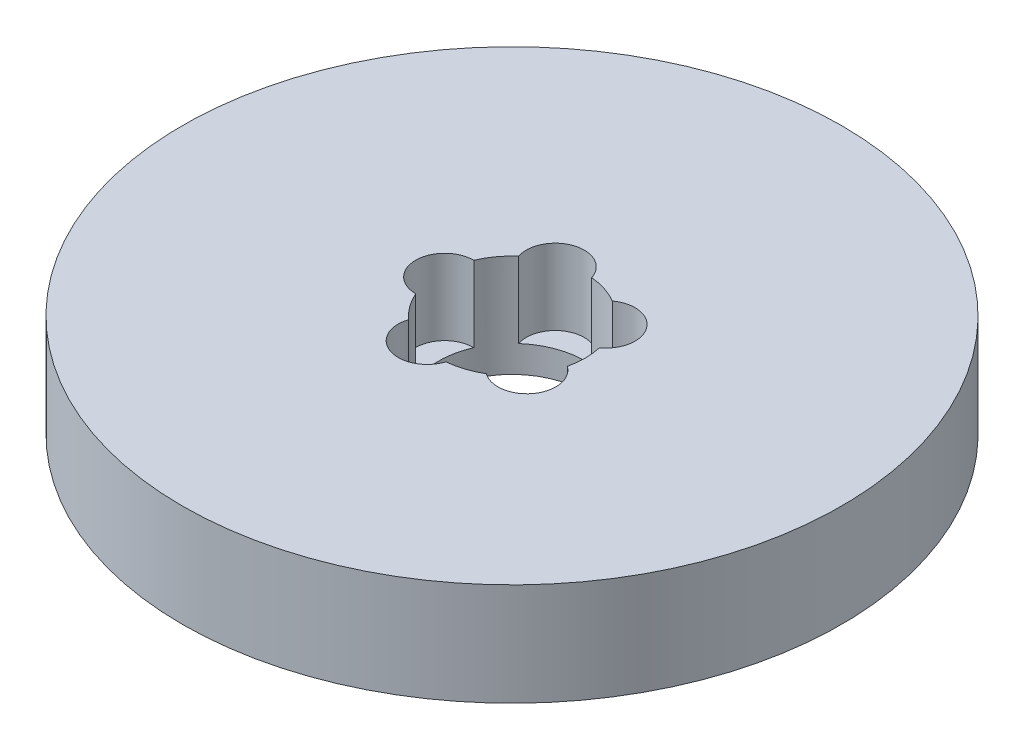
ISO-10303-21;
HEADER;
FILE_DESCRIPTION(('STEP AP214'),'2;1');
FILE_NAME('part.step','',(''),(''),'','','');
FILE_SCHEMA(('AUTOMOTIVE_DESIGN { 1 0 10303 214 1 1 1 1 }'));
ENDSEC;
DATA;
#1=APPLICATION_CONTEXT('core data for automotive mechanical design processes');
#2=APPLICATION_PROTOCOL_DEFINITION('international standard','automotive_design',2000,#1);
#3=PRODUCT_CONTEXT('',#1,'mechanical');
#4=PRODUCT('Part','Part','',(#3));
#5=PRODUCT_RELATED_PRODUCT_CATEGORY('part','',(#4));
#6=PRODUCT_DEFINITION_FORMATION('','',#4);
#7=PRODUCT_DEFINITION_CONTEXT('part definition',#1,'design');
#8=PRODUCT_DEFINITION('design','',#6,#7);
#9=PRODUCT_DEFINITION_SHAPE('','',#8);
#10=(LENGTH_UNIT() NAMED_UNIT(*) SI_UNIT(.MILLI.,.METRE.));
#11=(NAMED_UNIT(*) PLANE_ANGLE_UNIT() SI_UNIT($,.RADIAN.));
#12=(NAMED_UNIT(*) SI_UNIT($,.STERADIAN.) SOLID_ANGLE_UNIT());
#13=UNCERTAINTY_MEASURE_WITH_UNIT(LENGTH_MEASURE(1.E-05),#10,'distance_accuracy_value','');
#14=(GEOMETRIC_REPRESENTATION_CONTEXT(3) GLOBAL_UNCERTAINTY_ASSIGNED_CONTEXT((#13)) GLOBAL_UNIT_ASSIGNED_CONTEXT((#10,
#11,#12)) REPRESENTATION_CONTEXT('',''));
#15=CARTESIAN_POINT('',(0.,0.,0.));
#16=DIRECTION('',(0.,0.,1.));
#17=DIRECTION('',(1.,0.,0.));
#18=AXIS2_PLACEMENT_3D('',#15,#16,#17);
#19=CARTESIAN_POINT('',(0.,7.,0.));
#20=DIRECTION('',(0.,-1.,0.));
#21=DIRECTION('',(0.,0.,-1.));
#22=AXIS2_PLACEMENT_3D('',#19,#20,#21);
#23=CYLINDRICAL_SURFACE('',#22,22.5);
#24=CARTESIAN_POINT('',(0.,7.,0.));
#25=DIRECTION('',(0.,1.,0.));
#26=DIRECTION('',(0.,0.,1.));
#27=AXIS2_PLACEMENT_3D('',#24,#25,#26);
#28=CIRCLE('',#27,22.5);
#29=CARTESIAN_POINT('',(0.,7.,22.5));
#30=VERTEX_POINT('',#29);
#31=EDGE_CURVE('E157',#30,#30,#28,.T.);
#32=ORIENTED_EDGE('',*,*,#31,.F.);
#33=EDGE_LOOP('',(#32));
#34=FACE_BOUND('',#33,.T.);
#35=CARTESIAN_POINT('',(0.,0.,0.));
#36=DIRECTION('',(0.,1.,0.));
#37=DIRECTION('',(0.,0.,1.));
#38=AXIS2_PLACEMENT_3D('',#35,#36,#37);
#39=CIRCLE('',#38,22.5);
#40=CARTESIAN_POINT('',(0.,0.,22.5));
#41=VERTEX_POINT('',#40);
#42=EDGE_CURVE('E150',#41,#41,#39,.T.);
#43=ORIENTED_EDGE('',*,*,#42,.T.);
#44=EDGE_LOOP('',(#43));
#45=FACE_BOUND('',#44,.T.);
#46=ADVANCED_FACE('F39',(#34,#45),#23,.T.);
#47=CARTESIAN_POINT('',(0.,7.,0.));
#48=DIRECTION('',(0.,1.,0.));
#49=DIRECTION('',(0.,0.,1.));
#50=AXIS2_PLACEMENT_3D('',#47,#48,#49);
#51=PLANE('',#50);
#52=CARTESIAN_POINT('',(-1.42031490346653,7.,-4.37127979600344));
#53=DIRECTION('',(0.,1.,0.));
#54=DIRECTION('',(-0.95105651629515,0.,0.309016994374958));
#55=AXIS2_PLACEMENT_3D('',#52,#53,#54);
#56=CIRCLE('',#55,1.98142630119609);
#57=CARTESIAN_POINT('',(0.465854922201812,7.,-4.97825061557374));
#58=VERTEX_POINT('',#57);
#59=CARTESIAN_POINT('',(-3.30302684302474,7.,-3.75366669727854));
#60=VERTEX_POINT('',#59);
#61=EDGE_CURVE('E194',#58,#60,#56,.T.);
#62=ORIENTED_EDGE('',*,*,#61,.F.);
#63=CARTESIAN_POINT('',(0.,7.,0.));
#64=DIRECTION('',(0.,1.,0.));
#65=DIRECTION('',(0.,0.,1.));
#66=AXIS2_PLACEMENT_3D('',#63,#64,#65);
#67=CIRCLE('',#66,5.);
#68=CARTESIAN_POINT('',(2.5492577450756,7.,-4.30131200323483));
#69=VERTEX_POINT('',#68);
#70=EDGE_CURVE('E147',#69,#58,#67,.T.);
#71=ORIENTED_EDGE('',*,*,#70,.F.);
#72=CARTESIAN_POINT('',(3.71843269200326,7.,-2.70159948826588));
#73=DIRECTION('',(0.,1.,0.));
#74=DIRECTION('',(-0.58778525229248,0.,-0.809016994374942));
#75=AXIS2_PLACEMENT_3D('',#72,#73,#74);
#76=CIRCLE('',#75,1.98142630119609);
#77=CARTESIAN_POINT('',(4.87855477556535,7.,-1.09530968306161));
#78=VERTEX_POINT('',#77);
#79=EDGE_CURVE('E254',#78,#69,#76,.T.);
#80=ORIENTED_EDGE('',*,*,#79,.F.);
#81=CARTESIAN_POINT('',(4.87855477556537,7.,1.09530968306154));
#82=VERTEX_POINT('',#81);
#83=EDGE_CURVE('E144',#82,#78,#67,.T.);
#84=ORIENTED_EDGE('',*,*,#83,.F.);
#85=CARTESIAN_POINT('',(3.7184326920033,7.,2.70159948826582));
#86=DIRECTION('',(0.,1.,0.));
#87=DIRECTION('',(0.587785252292469,0.,-0.809016994374951));
#88=AXIS2_PLACEMENT_3D('',#85,#86,#87);
#89=CIRCLE('',#88,1.98142630119609);
#90=CARTESIAN_POINT('',(2.54925774507566,7.,4.3013120032348));
#91=VERTEX_POINT('',#90);
#92=EDGE_CURVE('E141',#91,#82,#89,.T.);
#93=ORIENTED_EDGE('',*,*,#92,.F.);
#94=CARTESIAN_POINT('',(0.465854922201883,7.,4.97825061557374));
#95=VERTEX_POINT('',#94);
#96=EDGE_CURVE('E134',#95,#91,#67,.T.);
#97=ORIENTED_EDGE('',*,*,#96,.F.);
#98=CARTESIAN_POINT('',(-1.42031490346647,7.,4.37127979600346));
#99=DIRECTION('',(0.,1.,0.));
#100=DIRECTION('',(0.951056516295155,0.,0.309016994374945));
#101=AXIS2_PLACEMENT_3D('',#98,#99,#100);
#102=CIRCLE('',#101,1.98142630119609);
#103=CARTESIAN_POINT('',(-3.30302684302469,7.,3.75366669727859));
#104=VERTEX_POINT('',#103);
#105=EDGE_CURVE('E111',#104,#95,#102,.T.);
#106=ORIENTED_EDGE('',*,*,#105,.F.);
#107=CARTESIAN_POINT('',(-4.59064059981817,7.,1.98141840187809));
#108=VERTEX_POINT('',#107);
#109=EDGE_CURVE('E145',#108,#104,#67,.T.);
#110=ORIENTED_EDGE('',*,*,#109,.F.);
#111=CARTESIAN_POINT('',(-4.5962355770736,7.,0.));
#112=DIRECTION('',(0.,1.,0.));
#113=DIRECTION('',(0.,0.,1.));
#114=AXIS2_PLACEMENT_3D('',#111,#112,#113);
#115=CIRCLE('',#114,1.98142630119609);
#116=CARTESIAN_POINT('',(-4.59064059981817,7.,-1.98141840187809));
#117=VERTEX_POINT('',#116);
#118=EDGE_CURVE('E153',#117,#108,#115,.T.);
#119=ORIENTED_EDGE('',*,*,#118,.F.);
#120=EDGE_CURVE('E146',#60,#117,#67,.T.);
#121=ORIENTED_EDGE('',*,*,#120,.F.);
#122=EDGE_LOOP('',(#62,#71,#80,#84,#93,#97,#106,#110,#119,#121));
#123=FACE_BOUND('',#122,.T.);
#124=ORIENTED_EDGE('',*,*,#31,.T.);
#125=EDGE_LOOP('',(#124));
#126=FACE_BOUND('',#125,.T.);
#127=ADVANCED_FACE('F139',(#123,#126),#51,.T.);
#128=CARTESIAN_POINT('',(0.,0.,0.));
#129=DIRECTION('',(0.,1.,0.));
#130=DIRECTION('',(0.,0.,1.));
#131=AXIS2_PLACEMENT_3D('',#128,#129,#130);
#132=PLANE('',#131);
#133=CARTESIAN_POINT('',(0.,0.,0.));
#134=DIRECTION('',(0.,1.,0.));
#135=DIRECTION('',(0.,0.,1.));
#136=AXIS2_PLACEMENT_3D('',#133,#134,#135);
#137=CIRCLE('',#136,5.);
#138=CARTESIAN_POINT('',(0.,0.,5.));
#139=VERTEX_POINT('',#138);
#140=EDGE_CURVE('E154',#139,#139,#137,.T.);
#141=ORIENTED_EDGE('',*,*,#140,.T.);
#142=EDGE_LOOP('',(#141));
#143=FACE_BOUND('',#142,.T.);
#144=ORIENTED_EDGE('',*,*,#42,.F.);
#145=EDGE_LOOP('',(#144));
#146=FACE_BOUND('',#145,.T.);
#147=ADVANCED_FACE('F213',(#143,#146),#132,.F.);
#148=CARTESIAN_POINT('',(0.,7.,0.));
#149=DIRECTION('',(0.,-1.,0.));
#150=DIRECTION('',(0.,0.,-1.));
#151=AXIS2_PLACEMENT_3D('',#148,#149,#150);
#152=CYLINDRICAL_SURFACE('',#151,5.);
#153=DIRECTION('',(0.,1.,0.));
#154=VECTOR('',#153,1.);
#155=CARTESIAN_POINT('',(0.465854922201813,4.41702713443401,-4.97825061557374));
#156=LINE('',#155,#154);
#157=CARTESIAN_POINT('',(0.465854922201812,1.83405426886802,-4.97825061557374));
#158=VERTEX_POINT('',#157);
#159=EDGE_CURVE('E11',#158,#58,#156,.T.);
#160=ORIENTED_EDGE('',*,*,#159,.F.);
#161=CARTESIAN_POINT('',(0.,1.83405426886802,0.));
#162=DIRECTION('',(0.,1.,0.));
#163=DIRECTION('',(0.,0.,1.));
#164=AXIS2_PLACEMENT_3D('',#161,#162,#163);
#165=CIRCLE('',#164,5.);
#166=CARTESIAN_POINT('',(-3.30302684302474,1.83405426886802,-3.75366669727854));
#167=VERTEX_POINT('',#166);
#168=EDGE_CURVE('E189',#158,#167,#165,.T.);
#169=ORIENTED_EDGE('',*,*,#168,.T.);
#170=DIRECTION('',(0.,1.,0.));
#171=VECTOR('',#170,1.);
#172=CARTESIAN_POINT('',(-3.30302684302474,4.41702713443401,-3.75366669727854));
#173=LINE('',#172,#171);
#174=EDGE_CURVE('E46',#60,#167,#173,.F.);
#175=ORIENTED_EDGE('',*,*,#174,.F.);
#176=ORIENTED_EDGE('',*,*,#120,.T.);
#177=DIRECTION('',(0.,1.,0.));
#178=VECTOR('',#177,1.);
#179=CARTESIAN_POINT('',(-4.59064059981817,4.41702713443401,-1.98141840187809));
#180=LINE('',#179,#178);
#181=CARTESIAN_POINT('',(-4.59064059981817,1.83405426886802,-1.98141840187809));
#182=VERTEX_POINT('',#181);
#183=EDGE_CURVE('E168',#182,#117,#180,.T.);
#184=ORIENTED_EDGE('',*,*,#183,.F.);
#185=CARTESIAN_POINT('',(0.,1.83405426886802,0.));
#186=DIRECTION('',(0.,1.,0.));
#187=DIRECTION('',(0.,0.,1.));
#188=AXIS2_PLACEMENT_3D('',#185,#186,#187);
#189=CIRCLE('',#188,5.);
#190=CARTESIAN_POINT('',(-4.59064059981817,1.83405426886802,1.98141840187809));
#191=VERTEX_POINT('',#190);
#192=EDGE_CURVE('E165',#182,#191,#189,.T.);
#193=ORIENTED_EDGE('',*,*,#192,.T.);
#194=DIRECTION('',(0.,1.,0.));
#195=VECTOR('',#194,1.);
#196=CARTESIAN_POINT('',(-4.59064059981817,4.41702713443401,1.98141840187809));
#197=LINE('',#196,#195);
#198=EDGE_CURVE('E170',#108,#191,#197,.F.);
#199=ORIENTED_EDGE('',*,*,#198,.F.);
#200=ORIENTED_EDGE('',*,*,#109,.T.);
#201=DIRECTION('',(0.,1.,0.));
#202=VECTOR('',#201,1.);
#203=CARTESIAN_POINT('',(-3.30302684302469,4.41702713443401,3.75366669727859));
#204=LINE('',#203,#202);
#205=CARTESIAN_POINT('',(-3.30302684302469,1.83405426886802,3.75366669727859));
#206=VERTEX_POINT('',#205);
#207=EDGE_CURVE('E121',#206,#104,#204,.T.);
#208=ORIENTED_EDGE('',*,*,#207,.F.);
#209=CARTESIAN_POINT('',(0.,1.83405426886802,0.));
#210=DIRECTION('',(0.,1.,0.));
#211=DIRECTION('',(0.,0.,1.));
#212=AXIS2_PLACEMENT_3D('',#209,#210,#211);
#213=CIRCLE('',#212,5.);
#214=CARTESIAN_POINT('',(0.465854922201883,1.83405426886802,4.97825061557374));
#215=VERTEX_POINT('',#214);
#216=EDGE_CURVE('E136',#206,#215,#213,.T.);
#217=ORIENTED_EDGE('',*,*,#216,.T.);
#218=DIRECTION('',(0.,1.,0.));
#219=VECTOR('',#218,1.);
#220=CARTESIAN_POINT('',(0.465854922201883,4.41702713443401,4.97825061557374));
#221=LINE('',#220,#219);
#222=EDGE_CURVE('E117',#95,#215,#221,.F.);
#223=ORIENTED_EDGE('',*,*,#222,.F.);
#224=ORIENTED_EDGE('',*,*,#96,.T.);
#225=DIRECTION('',(0.,1.,0.));
#226=VECTOR('',#225,1.);
#227=CARTESIAN_POINT('',(2.54925774507566,4.41702713443401,4.3013120032348));
#228=LINE('',#227,#226);
#229=CARTESIAN_POINT('',(2.54925774507566,1.83405426886802,4.3013120032348));
#230=VERTEX_POINT('',#229);
#231=EDGE_CURVE('E182',#230,#91,#228,.T.);
#232=ORIENTED_EDGE('',*,*,#231,.F.);
#233=CARTESIAN_POINT('',(0.,1.83405426886802,0.));
#234=DIRECTION('',(0.,1.,0.));
#235=DIRECTION('',(0.,0.,1.));
#236=AXIS2_PLACEMENT_3D('',#233,#234,#235);
#237=CIRCLE('',#236,5.);
#238=CARTESIAN_POINT('',(4.87855477556537,1.83405426886802,1.09530968306154));
#239=VERTEX_POINT('',#238);
#240=EDGE_CURVE('E174',#230,#239,#237,.T.);
#241=ORIENTED_EDGE('',*,*,#240,.T.);
#242=DIRECTION('',(0.,1.,0.));
#243=VECTOR('',#242,1.);
#244=CARTESIAN_POINT('',(4.87855477556537,4.41702713443401,1.09530968306154));
#245=LINE('',#244,#243);
#246=EDGE_CURVE('E177',#82,#239,#245,.F.);
#247=ORIENTED_EDGE('',*,*,#246,.F.);
#248=ORIENTED_EDGE('',*,*,#83,.T.);
#249=DIRECTION('',(0.,1.,0.));
#250=VECTOR('',#249,1.);
#251=CARTESIAN_POINT('',(4.87855477556535,4.41702713443401,-1.09530968306161));
#252=LINE('',#251,#250);
#253=CARTESIAN_POINT('',(4.87855477556535,1.83405426886802,-1.09530968306161));
#254=VERTEX_POINT('',#253);
#255=EDGE_CURVE('E187',#254,#78,#252,.T.);
#256=ORIENTED_EDGE('',*,*,#255,.F.);
#257=CARTESIAN_POINT('',(0.,1.83405426886802,0.));
#258=DIRECTION('',(0.,1.,0.));
#259=DIRECTION('',(0.,0.,1.));
#260=AXIS2_PLACEMENT_3D('',#257,#258,#259);
#261=CIRCLE('',#260,5.);
#262=CARTESIAN_POINT('',(2.5492577450756,1.83405426886802,-4.30131200323483));
#263=VERTEX_POINT('',#262);
#264=EDGE_CURVE('E181',#254,#263,#261,.T.);
#265=ORIENTED_EDGE('',*,*,#264,.T.);
#266=DIRECTION('',(0.,1.,0.));
#267=VECTOR('',#266,1.);
#268=CARTESIAN_POINT('',(2.5492577450756,4.41702713443401,-4.30131200323483));
#269=LINE('',#268,#267);
#270=EDGE_CURVE('E186',#69,#263,#269,.F.);
#271=ORIENTED_EDGE('',*,*,#270,.F.);
#272=ORIENTED_EDGE('',*,*,#70,.T.);
#273=EDGE_LOOP('',(#160,#169,#175,#176,#184,#193,#199,#200,#208,#217,#223,#224,#232,#241,#247,
#248,#256,#265,#271,#272));
#274=FACE_BOUND('',#273,.T.);
#275=ORIENTED_EDGE('',*,*,#140,.F.);
#276=EDGE_LOOP('',(#275));
#277=FACE_BOUND('',#276,.T.);
#278=ADVANCED_FACE('F135',(#274,#277),#152,.F.);
#279=CARTESIAN_POINT('',(-4.5962355770736,1.83405426886802,0.));
#280=DIRECTION('',(0.,1.,0.));
#281=DIRECTION('',(0.,0.,1.));
#282=AXIS2_PLACEMENT_3D('',#279,#280,#281);
#283=CYLINDRICAL_SURFACE('',#282,1.98142630119609);
#284=ORIENTED_EDGE('',*,*,#183,.T.);
#285=ORIENTED_EDGE('',*,*,#118,.T.);
#286=ORIENTED_EDGE('',*,*,#198,.T.);
#287=CARTESIAN_POINT('',(-4.5962355770736,1.83405426886802,0.));
#288=DIRECTION('',(0.,1.,0.));
#289=DIRECTION('',(0.,0.,1.));
#290=AXIS2_PLACEMENT_3D('',#287,#288,#289);
#291=CIRCLE('',#290,1.98142630119609);
#292=EDGE_CURVE('E158',#182,#191,#291,.T.);
#293=ORIENTED_EDGE('',*,*,#292,.F.);
#294=EDGE_LOOP('',(#284,#285,#286,#293));
#295=FACE_BOUND('',#294,.T.);
#296=ADVANCED_FACE('F221',(#295),#283,.F.);
#297=CARTESIAN_POINT('',(-4.5962355770736,1.83405426886802,0.));
#298=DIRECTION('',(0.,1.,0.));
#299=DIRECTION('',(0.,0.,1.));
#300=AXIS2_PLACEMENT_3D('',#297,#298,#299);
#301=PLANE('',#300);
#302=ORIENTED_EDGE('',*,*,#292,.T.);
#303=ORIENTED_EDGE('',*,*,#192,.F.);
#304=EDGE_LOOP('',(#302,#303));
#305=FACE_BOUND('',#304,.T.);
#306=ADVANCED_FACE('F227',(#305),#301,.T.);
#307=CARTESIAN_POINT('',(-1.42031490346647,1.83405426886802,4.37127979600346));
#308=DIRECTION('',(0.,1.,0.));
#309=DIRECTION('',(0.,0.,1.));
#310=AXIS2_PLACEMENT_3D('',#307,#308,#309);
#311=CYLINDRICAL_SURFACE('',#310,1.98142630119609);
#312=ORIENTED_EDGE('',*,*,#207,.T.);
#313=ORIENTED_EDGE('',*,*,#105,.T.);
#314=ORIENTED_EDGE('',*,*,#222,.T.);
#315=CARTESIAN_POINT('',(-1.42031490346647,1.83405426886802,4.37127979600346));
#316=DIRECTION('',(0.,1.,0.));
#317=DIRECTION('',(0.951056516295155,0.,0.309016994374945));
#318=AXIS2_PLACEMENT_3D('',#315,#316,#317);
#319=CIRCLE('',#318,1.98142630119609);
#320=EDGE_CURVE('E127',#206,#215,#319,.T.);
#321=ORIENTED_EDGE('',*,*,#320,.F.);
#322=EDGE_LOOP('',(#312,#313,#314,#321));
#323=FACE_BOUND('',#322,.T.);
#324=ADVANCED_FACE('F116',(#323),#311,.F.);
#325=CARTESIAN_POINT('',(-1.42031490346647,1.83405426886802,4.37127979600346));
#326=DIRECTION('',(0.,1.,0.));
#327=DIRECTION('',(0.951056516295155,0.,0.309016994374945));
#328=AXIS2_PLACEMENT_3D('',#325,#326,#327);
#329=PLANE('',#328);
#330=ORIENTED_EDGE('',*,*,#320,.T.);
#331=ORIENTED_EDGE('',*,*,#216,.F.);
#332=EDGE_LOOP('',(#330,#331));
#333=FACE_BOUND('',#332,.T.);
#334=ADVANCED_FACE('F234',(#333),#329,.T.);
#335=CARTESIAN_POINT('',(3.7184326920033,1.83405426886802,2.70159948826582));
#336=DIRECTION('',(0.,1.,0.));
#337=DIRECTION('',(0.,0.,1.));
#338=AXIS2_PLACEMENT_3D('',#335,#336,#337);
#339=CYLINDRICAL_SURFACE('',#338,1.98142630119609);
#340=ORIENTED_EDGE('',*,*,#231,.T.);
#341=ORIENTED_EDGE('',*,*,#92,.T.);
#342=ORIENTED_EDGE('',*,*,#246,.T.);
#343=CARTESIAN_POINT('',(3.7184326920033,1.83405426886802,2.70159948826582));
#344=DIRECTION('',(0.,1.,0.));
#345=DIRECTION('',(0.587785252292469,0.,-0.809016994374951));
#346=AXIS2_PLACEMENT_3D('',#343,#344,#345);
#347=CIRCLE('',#346,1.98142630119609);
#348=EDGE_CURVE('E130',#230,#239,#347,.T.);
#349=ORIENTED_EDGE('',*,*,#348,.F.);
#350=EDGE_LOOP('',(#340,#341,#342,#349));
#351=FACE_BOUND('',#350,.T.);
#352=ADVANCED_FACE('F240',(#351),#339,.F.);
#353=CARTESIAN_POINT('',(3.7184326920033,1.83405426886802,2.70159948826582));
#354=DIRECTION('',(0.,1.,0.));
#355=DIRECTION('',(0.587785252292469,0.,-0.809016994374951));
#356=AXIS2_PLACEMENT_3D('',#353,#354,#355);
#357=PLANE('',#356);
#358=ORIENTED_EDGE('',*,*,#348,.T.);
#359=ORIENTED_EDGE('',*,*,#240,.F.);
#360=EDGE_LOOP('',(#358,#359));
#361=FACE_BOUND('',#360,.T.);
#362=ADVANCED_FACE('F245',(#361),#357,.T.);
#363=CARTESIAN_POINT('',(3.71843269200326,1.83405426886802,-2.70159948826588));
#364=DIRECTION('',(0.,1.,0.));
#365=DIRECTION('',(0.,0.,1.));
#366=AXIS2_PLACEMENT_3D('',#363,#364,#365);
#367=CYLINDRICAL_SURFACE('',#366,1.98142630119609);
#368=ORIENTED_EDGE('',*,*,#255,.T.);
#369=ORIENTED_EDGE('',*,*,#79,.T.);
#370=ORIENTED_EDGE('',*,*,#270,.T.);
#371=CARTESIAN_POINT('',(3.71843269200326,1.83405426886802,-2.70159948826588));
#372=DIRECTION('',(0.,1.,0.));
#373=DIRECTION('',(-0.58778525229248,0.,-0.809016994374942));
#374=AXIS2_PLACEMENT_3D('',#371,#372,#373);
#375=CIRCLE('',#374,1.98142630119609);
#376=EDGE_CURVE('E56',#254,#263,#375,.T.);
#377=ORIENTED_EDGE('',*,*,#376,.F.);
#378=EDGE_LOOP('',(#368,#369,#370,#377));
#379=FACE_BOUND('',#378,.T.);
#380=ADVANCED_FACE('F266',(#379),#367,.F.);
#381=CARTESIAN_POINT('',(3.71843269200326,1.83405426886802,-2.70159948826588));
#382=DIRECTION('',(0.,1.,0.));
#383=DIRECTION('',(-0.58778525229248,0.,-0.809016994374942));
#384=AXIS2_PLACEMENT_3D('',#381,#382,#383);
#385=PLANE('',#384);
#386=ORIENTED_EDGE('',*,*,#376,.T.);
#387=ORIENTED_EDGE('',*,*,#264,.F.);
#388=EDGE_LOOP('',(#386,#387));
#389=FACE_BOUND('',#388,.T.);
#390=ADVANCED_FACE('F204',(#389),#385,.T.);
#391=CARTESIAN_POINT('',(-1.42031490346653,1.83405426886802,-4.37127979600344));
#392=DIRECTION('',(0.,1.,0.));
#393=DIRECTION('',(0.,0.,1.));
#394=AXIS2_PLACEMENT_3D('',#391,#392,#393);
#395=CYLINDRICAL_SURFACE('',#394,1.98142630119609);
#396=ORIENTED_EDGE('',*,*,#159,.T.);
#397=ORIENTED_EDGE('',*,*,#61,.T.);
#398=ORIENTED_EDGE('',*,*,#174,.T.);
#399=CARTESIAN_POINT('',(-1.42031490346653,1.83405426886802,-4.37127979600344));
#400=DIRECTION('',(0.,1.,0.));
#401=DIRECTION('',(-0.95105651629515,0.,0.309016994374958));
#402=AXIS2_PLACEMENT_3D('',#399,#400,#401);
#403=CIRCLE('',#402,1.98142630119609);
#404=EDGE_CURVE('E55',#158,#167,#403,.T.);
#405=ORIENTED_EDGE('',*,*,#404,.F.);
#406=EDGE_LOOP('',(#396,#397,#398,#405));
#407=FACE_BOUND('',#406,.T.);
#408=ADVANCED_FACE('F193',(#407),#395,.F.);
#409=CARTESIAN_POINT('',(-1.42031490346653,1.83405426886802,-4.37127979600344));
#410=DIRECTION('',(0.,1.,0.));
#411=DIRECTION('',(-0.95105651629515,0.,0.309016994374958));
#412=AXIS2_PLACEMENT_3D('',#409,#410,#411);
#413=PLANE('',#412);
#414=ORIENTED_EDGE('',*,*,#404,.T.);
#415=ORIENTED_EDGE('',*,*,#168,.F.);
#416=EDGE_LOOP('',(#414,#415));
#417=FACE_BOUND('',#416,.T.);
#418=ADVANCED_FACE('F196',(#417),#413,.T.);
#419=CLOSED_SHELL('',(#46,#127,#147,#278,#296,#306,#324,#334,#352,#362,#380,#390,#408,#418));
#420=MANIFOLD_SOLID_BREP('B2',#419);
#421=ADVANCED_BREP_SHAPE_REPRESENTATION('',(#18,#420),#14);
#422=SHAPE_DEFINITION_REPRESENTATION(#9,#421);
ENDSEC;
END-ISO-10303-21;
